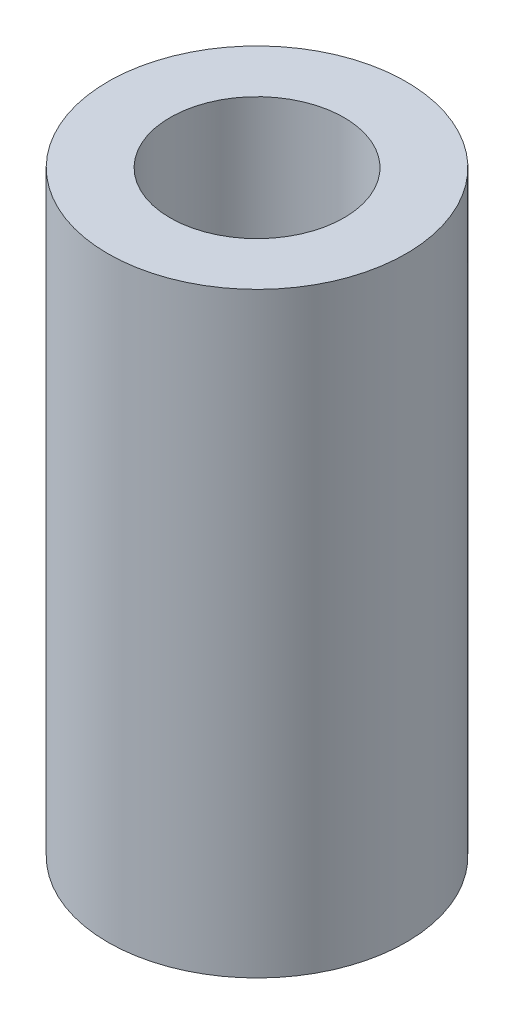
ISO-10303-21;
HEADER;
FILE_DESCRIPTION(('STEP AP214'),'2;1');
FILE_NAME('part.step','',(''),(''),'','','');
FILE_SCHEMA(('AUTOMOTIVE_DESIGN { 1 0 10303 214 1 1 1 1 }'));
ENDSEC;
DATA;
#1=APPLICATION_CONTEXT('core data for automotive mechanical design processes');
#2=APPLICATION_PROTOCOL_DEFINITION('international standard','automotive_design',2000,#1);
#3=PRODUCT_CONTEXT('',#1,'mechanical');
#4=PRODUCT('Part','Part','',(#3));
#5=PRODUCT_RELATED_PRODUCT_CATEGORY('part','',(#4));
#6=PRODUCT_DEFINITION_FORMATION('','',#4);
#7=PRODUCT_DEFINITION_CONTEXT('part definition',#1,'design');
#8=PRODUCT_DEFINITION('design','',#6,#7);
#9=PRODUCT_DEFINITION_SHAPE('','',#8);
#10=(LENGTH_UNIT() NAMED_UNIT(*) SI_UNIT(.MILLI.,.METRE.));
#11=(NAMED_UNIT(*) PLANE_ANGLE_UNIT() SI_UNIT($,.RADIAN.));
#12=(NAMED_UNIT(*) SI_UNIT($,.STERADIAN.) SOLID_ANGLE_UNIT());
#13=UNCERTAINTY_MEASURE_WITH_UNIT(LENGTH_MEASURE(1.E-05),#10,'distance_accuracy_value','');
#14=(GEOMETRIC_REPRESENTATION_CONTEXT(3) GLOBAL_UNCERTAINTY_ASSIGNED_CONTEXT((#13)) GLOBAL_UNIT_ASSIGNED_CONTEXT((#10,
#11,#12)) REPRESENTATION_CONTEXT('',''));
#15=CARTESIAN_POINT('',(0.,0.,0.));
#16=DIRECTION('',(0.,0.,1.));
#17=DIRECTION('',(1.,0.,0.));
#18=AXIS2_PLACEMENT_3D('',#15,#16,#17);
#19=CARTESIAN_POINT('',(0.,12.,0.));
#20=DIRECTION('',(0.,1.,0.));
#21=DIRECTION('',(0.,0.,1.));
#22=AXIS2_PLACEMENT_3D('',#19,#20,#21);
#23=PLANE('',#22);
#24=CARTESIAN_POINT('',(0.,12.,0.));
#25=DIRECTION('',(0.,1.,0.));
#26=DIRECTION('',(0.,0.,1.));
#27=AXIS2_PLACEMENT_3D('',#24,#25,#26);
#28=CIRCLE('',#27,3.);
#29=CARTESIAN_POINT('',(0.,12.,3.));
#30=VERTEX_POINT('',#29);
#31=EDGE_CURVE('E10',#30,#30,#28,.T.);
#32=ORIENTED_EDGE('',*,*,#31,.T.);
#33=EDGE_LOOP('',(#32));
#34=FACE_BOUND('',#33,.T.);
#35=CARTESIAN_POINT('',(0.,12.,0.));
#36=DIRECTION('',(0.,1.,0.));
#37=DIRECTION('',(0.,0.,1.));
#38=AXIS2_PLACEMENT_3D('',#35,#36,#37);
#39=CIRCLE('',#38,1.75);
#40=CARTESIAN_POINT('',(0.,12.,1.75));
#41=VERTEX_POINT('',#40);
#42=EDGE_CURVE('E52',#41,#41,#39,.T.);
#43=ORIENTED_EDGE('',*,*,#42,.F.);
#44=EDGE_LOOP('',(#43));
#45=FACE_BOUND('',#44,.T.);
#46=ADVANCED_FACE('F39',(#34,#45),#23,.T.);
#47=CARTESIAN_POINT('',(0.,0.,0.));
#48=DIRECTION('',(0.,1.,0.));
#49=DIRECTION('',(0.,0.,1.));
#50=AXIS2_PLACEMENT_3D('',#47,#48,#49);
#51=PLANE('',#50);
#52=CARTESIAN_POINT('',(0.,0.,0.));
#53=DIRECTION('',(0.,1.,0.));
#54=DIRECTION('',(0.,0.,1.));
#55=AXIS2_PLACEMENT_3D('',#52,#53,#54);
#56=CIRCLE('',#55,3.);
#57=CARTESIAN_POINT('',(0.,0.,3.));
#58=VERTEX_POINT('',#57);
#59=EDGE_CURVE('E43',#58,#58,#56,.T.);
#60=ORIENTED_EDGE('',*,*,#59,.F.);
#61=EDGE_LOOP('',(#60));
#62=FACE_BOUND('',#61,.T.);
#63=CARTESIAN_POINT('',(0.,0.,0.));
#64=DIRECTION('',(0.,1.,0.));
#65=DIRECTION('',(0.,0.,1.));
#66=AXIS2_PLACEMENT_3D('',#63,#64,#65);
#67=CIRCLE('',#66,1.75);
#68=CARTESIAN_POINT('',(0.,0.,1.75));
#69=VERTEX_POINT('',#68);
#70=EDGE_CURVE('E54',#69,#69,#67,.T.);
#71=ORIENTED_EDGE('',*,*,#70,.T.);
#72=EDGE_LOOP('',(#71));
#73=FACE_BOUND('',#72,.T.);
#74=ADVANCED_FACE('F66',(#62,#73),#51,.F.);
#75=CARTESIAN_POINT('',(0.,12.,0.));
#76=DIRECTION('',(0.,-1.,0.));
#77=DIRECTION('',(0.,0.,-1.));
#78=AXIS2_PLACEMENT_3D('',#75,#76,#77);
#79=CYLINDRICAL_SURFACE('',#78,3.);
#80=ORIENTED_EDGE('',*,*,#31,.F.);
#81=EDGE_LOOP('',(#80));
#82=FACE_BOUND('',#81,.T.);
#83=ORIENTED_EDGE('',*,*,#59,.T.);
#84=EDGE_LOOP('',(#83));
#85=FACE_BOUND('',#84,.T.);
#86=ADVANCED_FACE('F41',(#82,#85),#79,.T.);
#87=CARTESIAN_POINT('',(0.,12.,0.));
#88=DIRECTION('',(0.,-1.,0.));
#89=DIRECTION('',(0.,0.,-1.));
#90=AXIS2_PLACEMENT_3D('',#87,#88,#89);
#91=CYLINDRICAL_SURFACE('',#90,1.75);
#92=ORIENTED_EDGE('',*,*,#42,.T.);
#93=EDGE_LOOP('',(#92));
#94=FACE_BOUND('',#93,.T.);
#95=ORIENTED_EDGE('',*,*,#70,.F.);
#96=EDGE_LOOP('',(#95));
#97=FACE_BOUND('',#96,.T.);
#98=ADVANCED_FACE('F62',(#94,#97),#91,.F.);
#99=CLOSED_SHELL('',(#46,#74,#86,#98));
#100=MANIFOLD_SOLID_BREP('B2',#99);
#101=ADVANCED_BREP_SHAPE_REPRESENTATION('',(#18,#100),#14);
#102=SHAPE_DEFINITION_REPRESENTATION(#9,#101);
ENDSEC;
END-ISO-10303-21;
